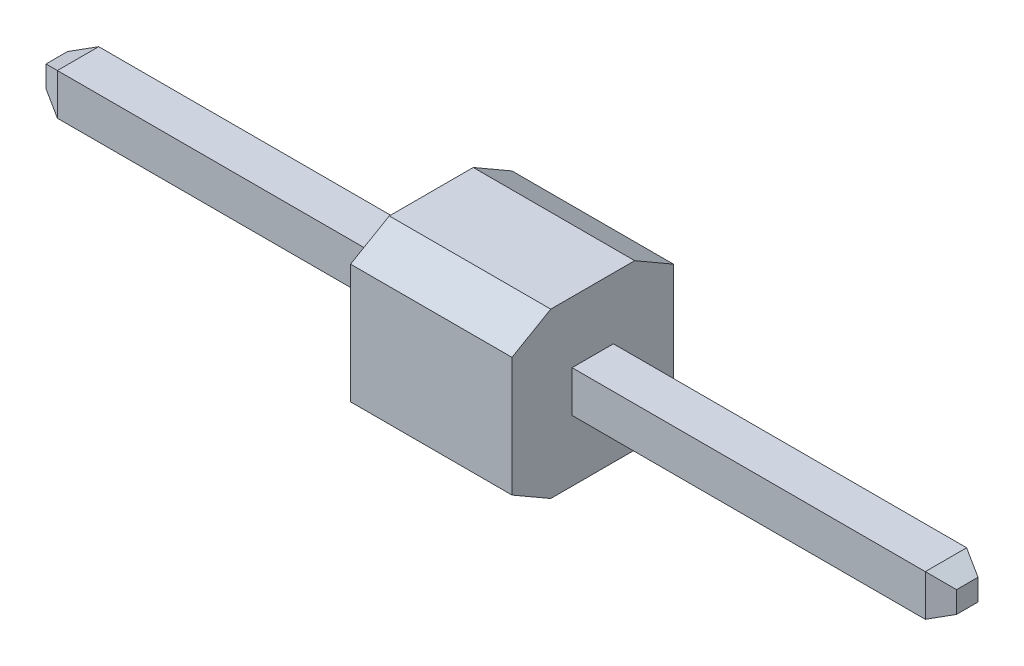
ISO-10303-21;
HEADER;
FILE_DESCRIPTION(('STEP AP214'),'2;1');
FILE_NAME('part.step','',(''),(''),'','','');
FILE_SCHEMA(('AUTOMOTIVE_DESIGN { 1 0 10303 214 1 1 1 1 }'));
ENDSEC;
DATA;
#1=APPLICATION_CONTEXT('core data for automotive mechanical design processes');
#2=APPLICATION_PROTOCOL_DEFINITION('international standard','automotive_design',2000,#1);
#3=PRODUCT_CONTEXT('',#1,'mechanical');
#4=PRODUCT('Part','Part','',(#3));
#5=PRODUCT_RELATED_PRODUCT_CATEGORY('part','',(#4));
#6=PRODUCT_DEFINITION_FORMATION('','',#4);
#7=PRODUCT_DEFINITION_CONTEXT('part definition',#1,'design');
#8=PRODUCT_DEFINITION('design','',#6,#7);
#9=PRODUCT_DEFINITION_SHAPE('','',#8);
#10=(LENGTH_UNIT() NAMED_UNIT(*) SI_UNIT(.MILLI.,.METRE.));
#11=(NAMED_UNIT(*) PLANE_ANGLE_UNIT() SI_UNIT($,.RADIAN.));
#12=(NAMED_UNIT(*) SI_UNIT($,.STERADIAN.) SOLID_ANGLE_UNIT());
#13=UNCERTAINTY_MEASURE_WITH_UNIT(LENGTH_MEASURE(1.E-05),#10,'distance_accuracy_value','');
#14=(GEOMETRIC_REPRESENTATION_CONTEXT(3) GLOBAL_UNCERTAINTY_ASSIGNED_CONTEXT((#13)) GLOBAL_UNIT_ASSIGNED_CONTEXT((#10,
#11,#12)) REPRESENTATION_CONTEXT('',''));
#15=CARTESIAN_POINT('',(0.,0.,0.));
#16=DIRECTION('',(0.,0.,1.));
#17=DIRECTION('',(1.,0.,0.));
#18=AXIS2_PLACEMENT_3D('',#15,#16,#17);
#19=CARTESIAN_POINT('',(5.42104992795993,4.76287173708609,0.629998634255617));
#20=DIRECTION('',(1.,4.37113882867379E-08,-4.37113882867379E-08));
#21=DIRECTION('',(-4.37113882867379E-08,1.,0.));
#22=AXIS2_PLACEMENT_3D('',#19,#20,#21);
#23=PLANE('',#22);
#24=DIRECTION('',(1.59994790123753E-08,0.50000000000019,0.866025403784329));
#25=VECTOR('',#24,1.);
#26=CARTESIAN_POINT('',(5.42104980497401,6.00646157557209,-0.940001365744382));
#27=LINE('',#26,#25);
#28=CARTESIAN_POINT('',(5.42104980497401,6.00646157557209,-0.940001365744382));
#29=VERTEX_POINT('',#28);
#30=CARTESIAN_POINT('',(5.42104981605878,6.35287173708609,-0.340001365744383));
#31=VERTEX_POINT('',#30);
#32=EDGE_CURVE('E11',#29,#31,#27,.T.);
#33=ORIENTED_EDGE('',*,*,#32,.T.);
#34=DIRECTION('',(4.37113886966664E-08,0.,0.999999999999999));
#35=VECTOR('',#34,1.);
#36=CARTESIAN_POINT('',(5.42104981605878,6.35287173708609,-0.340001365744383));
#37=LINE('',#36,#35);
#38=CARTESIAN_POINT('',(5.42104987288358,6.35287173708609,0.959998634255618));
#39=VERTEX_POINT('',#38);
#40=EDGE_CURVE('E304',#31,#39,#37,.T.);
#41=ORIENTED_EDGE('',*,*,#40,.T.);
#42=DIRECTION('',(5.97108656004285E-08,-0.500000000000189,0.866025403784328));
#43=VECTOR('',#42,1.);
#44=CARTESIAN_POINT('',(5.42104987288358,6.35287173708609,0.959998634255618));
#45=LINE('',#44,#43);
#46=CARTESIAN_POINT('',(5.42104991425248,6.00646157557209,1.55999863425562));
#47=VERTEX_POINT('',#46);
#48=EDGE_CURVE('E296',#39,#47,#45,.T.);
#49=ORIENTED_EDGE('',*,*,#48,.T.);
#50=DIRECTION('',(4.37113884815072E-08,-0.999999999999999,0.));
#51=VECTOR('',#50,1.);
#52=CARTESIAN_POINT('',(5.42104991425248,6.00646157557209,1.55999863425562));
#53=LINE('',#52,#51);
#54=CARTESIAN_POINT('',(5.42104999499527,4.15928189860009,1.55999863425562));
#55=VERTEX_POINT('',#54);
#56=EDGE_CURVE('E281',#47,#55,#53,.T.);
#57=ORIENTED_EDGE('',*,*,#56,.T.);
#58=DIRECTION('',(1.59994790123752E-08,0.500000000000192,0.866025403784328));
#59=VECTOR('',#58,1.);
#60=CARTESIAN_POINT('',(5.42104998391051,3.81287173708609,0.959998634255618));
#61=LINE('',#60,#59);
#62=CARTESIAN_POINT('',(5.42104998391051,3.81287173708609,0.959998634255618));
#63=VERTEX_POINT('',#62);
#64=EDGE_CURVE('E265',#63,#55,#61,.T.);
#65=ORIENTED_EDGE('',*,*,#64,.F.);
#66=DIRECTION('',(4.37113880134522E-08,0.,0.999999999999999));
#67=VECTOR('',#66,1.);
#68=CARTESIAN_POINT('',(5.4210499270857,3.81287173708609,-0.340001365744383));
#69=LINE('',#68,#67);
#70=CARTESIAN_POINT('',(5.4210499270857,3.81287173708609,-0.340001365744383));
#71=VERTEX_POINT('',#70);
#72=EDGE_CURVE('E248',#71,#63,#69,.T.);
#73=ORIENTED_EDGE('',*,*,#72,.F.);
#74=DIRECTION('',(5.97108668824036E-08,-0.500000000000187,0.866025403784328));
#75=VECTOR('',#74,1.);
#76=CARTESIAN_POINT('',(5.4210498857168,4.15928189860008,-0.940001365744382));
#77=LINE('',#76,#75);
#78=CARTESIAN_POINT('',(5.4210498857168,4.15928189860008,-0.940001365744382));
#79=VERTEX_POINT('',#78);
#80=EDGE_CURVE('E242',#79,#71,#77,.T.);
#81=ORIENTED_EDGE('',*,*,#80,.F.);
#82=DIRECTION('',(4.37113884815072E-08,-0.999999999999999,0.));
#83=VECTOR('',#82,1.);
#84=CARTESIAN_POINT('',(5.42104980497401,6.00646157557209,-0.940001365744382));
#85=LINE('',#84,#83);
#86=EDGE_CURVE('E236',#29,#79,#85,.T.);
#87=ORIENTED_EDGE('',*,*,#86,.F.);
#88=EDGE_LOOP('',(#33,#41,#49,#57,#65,#73,#81,#87));
#89=FACE_BOUND('',#88,.T.);
#90=DIRECTION('',(-4.37113886753159E-08,0.,-0.999999999999999));
#91=VECTOR('',#90,1.);
#92=CARTESIAN_POINT('',(5.42104989998464,5.40287173708609,0.629998634255617));
#93=LINE('',#92,#91);
#94=CARTESIAN_POINT('',(5.42104989998464,5.40287173708609,0.629998634255617));
#95=VERTEX_POINT('',#94);
#96=CARTESIAN_POINT('',(5.42104987200935,5.40287173708609,-0.0100013657443826));
#97=VERTEX_POINT('',#96);
#98=EDGE_CURVE('E302',#95,#97,#93,.T.);
#99=ORIENTED_EDGE('',*,*,#98,.T.);
#100=DIRECTION('',(-4.3711388675316E-08,0.999999999999999,0.));
#101=VECTOR('',#100,1.);
#102=CARTESIAN_POINT('',(5.42104989998464,4.76287173708609,-0.0100013657443826));
#103=LINE('',#102,#101);
#104=CARTESIAN_POINT('',(5.42104989998464,4.76287173708609,-0.0100013657443826));
#105=VERTEX_POINT('',#104);
#106=EDGE_CURVE('E293',#105,#97,#103,.T.);
#107=ORIENTED_EDGE('',*,*,#106,.F.);
#108=DIRECTION('',(-4.37113886753159E-08,0.,-0.999999999999999));
#109=VECTOR('',#108,1.);
#110=CARTESIAN_POINT('',(5.42104992795993,4.76287173708609,0.629998634255617));
#111=LINE('',#110,#109);
#112=CARTESIAN_POINT('',(5.42104992795993,4.76287173708609,0.629998634255617));
#113=VERTEX_POINT('',#112);
#114=EDGE_CURVE('E278',#113,#105,#111,.T.);
#115=ORIENTED_EDGE('',*,*,#114,.F.);
#116=DIRECTION('',(-4.3711388675316E-08,0.999999999999999,0.));
#117=VECTOR('',#116,1.);
#118=CARTESIAN_POINT('',(5.42104992795993,4.76287173708609,0.629998634255617));
#119=LINE('',#118,#117);
#120=EDGE_CURVE('E263',#113,#95,#119,.T.);
#121=ORIENTED_EDGE('',*,*,#120,.T.);
#122=EDGE_LOOP('',(#99,#107,#115,#121));
#123=FACE_BOUND('',#122,.T.);
#124=ADVANCED_FACE('F17',(#89,#123),#23,.T.);
#125=CARTESIAN_POINT('',(2.92104992795993,4.76287162780762,0.629998743534088));
#126=DIRECTION('',(1.,4.37113882867379E-08,-4.37113882867379E-08));
#127=DIRECTION('',(-4.37113882867379E-08,1.,0.));
#128=AXIS2_PLACEMENT_3D('',#125,#126,#127);
#129=PLANE('',#128);
#130=DIRECTION('',(1.59994790123753E-08,0.50000000000019,0.866025403784329));
#131=VECTOR('',#130,1.);
#132=CARTESIAN_POINT('',(2.92104980497401,6.00646146629361,-0.940001256465912));
#133=LINE('',#132,#131);
#134=CARTESIAN_POINT('',(2.92104980497401,6.00646146629361,-0.940001256465912));
#135=VERTEX_POINT('',#134);
#136=CARTESIAN_POINT('',(2.92104981605878,6.35287162780762,-0.340001256465912));
#137=VERTEX_POINT('',#136);
#138=EDGE_CURVE('E24',#135,#137,#133,.T.);
#139=ORIENTED_EDGE('',*,*,#138,.F.);
#140=DIRECTION('',(4.37113884815072E-08,-0.999999999999999,0.));
#141=VECTOR('',#140,1.);
#142=CARTESIAN_POINT('',(2.92104980497401,6.00646146629361,-0.940001256465912));
#143=LINE('',#142,#141);
#144=CARTESIAN_POINT('',(2.9210498857168,4.15928178932161,-0.940001256465912));
#145=VERTEX_POINT('',#144);
#146=EDGE_CURVE('E300',#135,#145,#143,.T.);
#147=ORIENTED_EDGE('',*,*,#146,.T.);
#148=DIRECTION('',(5.97108668824036E-08,-0.500000000000187,0.866025403784328));
#149=VECTOR('',#148,1.);
#150=CARTESIAN_POINT('',(2.9210498857168,4.15928178932161,-0.940001256465912));
#151=LINE('',#150,#149);
#152=CARTESIAN_POINT('',(2.9210499270857,3.81287162780762,-0.340001256465912));
#153=VERTEX_POINT('',#152);
#154=EDGE_CURVE('E286',#145,#153,#151,.T.);
#155=ORIENTED_EDGE('',*,*,#154,.T.);
#156=DIRECTION('',(4.37113880134522E-08,0.,0.999999999999999));
#157=VECTOR('',#156,1.);
#158=CARTESIAN_POINT('',(2.9210499270857,3.81287162780762,-0.340001256465912));
#159=LINE('',#158,#157);
#160=CARTESIAN_POINT('',(2.92104998391051,3.81287162780762,0.959998743534088));
#161=VERTEX_POINT('',#160);
#162=EDGE_CURVE('E271',#153,#161,#159,.T.);
#163=ORIENTED_EDGE('',*,*,#162,.T.);
#164=DIRECTION('',(1.59994790123752E-08,0.500000000000192,0.866025403784328));
#165=VECTOR('',#164,1.);
#166=CARTESIAN_POINT('',(2.92104998391051,3.81287162780762,0.959998743534088));
#167=LINE('',#166,#165);
#168=CARTESIAN_POINT('',(2.92104999499527,4.15928178932162,1.55999874353409));
#169=VERTEX_POINT('',#168);
#170=EDGE_CURVE('E253',#161,#169,#167,.T.);
#171=ORIENTED_EDGE('',*,*,#170,.T.);
#172=DIRECTION('',(4.37113884815072E-08,-0.999999999999999,0.));
#173=VECTOR('',#172,1.);
#174=CARTESIAN_POINT('',(2.92104991425248,6.00646146629362,1.55999874353409));
#175=LINE('',#174,#173);
#176=CARTESIAN_POINT('',(2.92104991425248,6.00646146629362,1.55999874353409));
#177=VERTEX_POINT('',#176);
#178=EDGE_CURVE('E261',#177,#169,#175,.T.);
#179=ORIENTED_EDGE('',*,*,#178,.F.);
#180=DIRECTION('',(5.9710866241416E-08,-0.500000000000189,0.866025403784328));
#181=VECTOR('',#180,1.);
#182=CARTESIAN_POINT('',(2.92104987288358,6.35287162780762,0.959998743534088));
#183=LINE('',#182,#181);
#184=CARTESIAN_POINT('',(2.92104987288358,6.35287162780762,0.959998743534088));
#185=VERTEX_POINT('',#184);
#186=EDGE_CURVE('E276',#185,#177,#183,.T.);
#187=ORIENTED_EDGE('',*,*,#186,.F.);
#188=DIRECTION('',(4.37113883550593E-08,0.,0.999999999999999));
#189=VECTOR('',#188,1.);
#190=CARTESIAN_POINT('',(2.92104981605878,6.35287162780762,-0.340001256465912));
#191=LINE('',#190,#189);
#192=EDGE_CURVE('E291',#137,#185,#191,.T.);
#193=ORIENTED_EDGE('',*,*,#192,.F.);
#194=EDGE_LOOP('',(#139,#147,#155,#163,#171,#179,#187,#193));
#195=FACE_BOUND('',#194,.T.);
#196=DIRECTION('',(-4.37113879814266E-08,0.999999999999999,0.));
#197=VECTOR('',#196,1.);
#198=CARTESIAN_POINT('',(2.92104989998464,4.76287162780762,-0.0100012564659119));
#199=LINE('',#198,#197);
#200=CARTESIAN_POINT('',(2.92104989998464,4.76287162780762,-0.0100012564659119));
#201=VERTEX_POINT('',#200);
#202=CARTESIAN_POINT('',(2.92104987200935,5.40287162780762,-0.0100012564659119));
#203=VERTEX_POINT('',#202);
#204=EDGE_CURVE('E298',#201,#203,#199,.T.);
#205=ORIENTED_EDGE('',*,*,#204,.T.);
#206=DIRECTION('',(-4.37113879814266E-08,0.,-0.999999999999999));
#207=VECTOR('',#206,1.);
#208=CARTESIAN_POINT('',(2.92104989998464,5.40287162780762,0.629998743534088));
#209=LINE('',#208,#207);
#210=CARTESIAN_POINT('',(2.92104989998464,5.40287162780762,0.629998743534088));
#211=VERTEX_POINT('',#210);
#212=EDGE_CURVE('E283',#211,#203,#209,.T.);
#213=ORIENTED_EDGE('',*,*,#212,.F.);
#214=DIRECTION('',(-4.3711388675316E-08,0.999999999999999,0.));
#215=VECTOR('',#214,1.);
#216=CARTESIAN_POINT('',(2.92104992795993,4.76287162780762,0.629998743534088));
#217=LINE('',#216,#215);
#218=CARTESIAN_POINT('',(2.92104992795993,4.76287162780762,0.629998743534088));
#219=VERTEX_POINT('',#218);
#220=EDGE_CURVE('E268',#219,#211,#217,.T.);
#221=ORIENTED_EDGE('',*,*,#220,.F.);
#222=DIRECTION('',(-4.37113886753159E-08,0.,-0.999999999999999));
#223=VECTOR('',#222,1.);
#224=CARTESIAN_POINT('',(2.92104992795993,4.76287162780762,0.629998743534088));
#225=LINE('',#224,#223);
#226=EDGE_CURVE('E251',#219,#201,#225,.T.);
#227=ORIENTED_EDGE('',*,*,#226,.T.);
#228=EDGE_LOOP('',(#205,#213,#221,#227));
#229=FACE_BOUND('',#228,.T.);
#230=ADVANCED_FACE('F314',(#195,#229),#129,.F.);
#231=CARTESIAN_POINT('',(5.42104980497401,6.00646157557209,-0.940001365744382));
#232=DIRECTION('',(5.97108668343731E-08,-0.866025403784328,0.50000000000019));
#233=DIRECTION('',(-1.59994785476185E-08,-0.500000000000192,-0.866025403784329));
#234=AXIS2_PLACEMENT_3D('',#231,#232,#233);
#235=PLANE('',#234);
#236=ORIENTED_EDGE('',*,*,#138,.T.);
#237=DIRECTION('',(-0.999999999999998,-4.37113886420092E-08,4.37113883755557E-08));
#238=VECTOR('',#237,1.);
#239=CARTESIAN_POINT('',(5.42104981605878,6.35287173708609,-0.340001365744383));
#240=LINE('',#239,#238);
#241=EDGE_CURVE('E288',#31,#137,#240,.T.);
#242=ORIENTED_EDGE('',*,*,#241,.F.);
#243=ORIENTED_EDGE('',*,*,#32,.F.);
#244=DIRECTION('',(-0.999999999999998,-4.37113889972806E-08,4.37113881091022E-08));
#245=VECTOR('',#244,1.);
#246=CARTESIAN_POINT('',(5.42104980497401,6.00646157557209,-0.940001365744382));
#247=LINE('',#246,#245);
#248=EDGE_CURVE('E256',#29,#135,#247,.T.);
#249=ORIENTED_EDGE('',*,*,#248,.T.);
#250=EDGE_LOOP('',(#236,#242,#243,#249));
#251=FACE_BOUND('',#250,.T.);
#252=ADVANCED_FACE('F306',(#251),#235,.F.);
#253=CARTESIAN_POINT('',(5.42104981605878,6.35287173708609,-0.340001365744383));
#254=DIRECTION('',(4.37113882867379E-08,-1.,0.));
#255=DIRECTION('',(1.,4.37113882867379E-08,-4.37113882867379E-08));
#256=AXIS2_PLACEMENT_3D('',#253,#254,#255);
#257=PLANE('',#256);
#258=ORIENTED_EDGE('',*,*,#192,.T.);
#259=DIRECTION('',(-0.999999999999998,-4.37113886420092E-08,4.37113882867378E-08));
#260=VECTOR('',#259,1.);
#261=CARTESIAN_POINT('',(5.42104987288358,6.35287173708609,0.959998634255618));
#262=LINE('',#261,#260);
#263=EDGE_CURVE('E273',#39,#185,#262,.T.);
#264=ORIENTED_EDGE('',*,*,#263,.F.);
#265=ORIENTED_EDGE('',*,*,#40,.F.);
#266=ORIENTED_EDGE('',*,*,#241,.T.);
#267=EDGE_LOOP('',(#258,#264,#265,#266));
#268=FACE_BOUND('',#267,.T.);
#269=ADVANCED_FACE('F311',(#268),#257,.F.);
#270=CARTESIAN_POINT('',(5.42104987288358,6.35287173708609,0.959998634255618));
#271=DIRECTION('',(1.59994785476185E-08,-0.86602540378433,-0.50000000000019));
#272=DIRECTION('',(-5.97108668343731E-08,0.500000000000188,-0.866025403784329));
#273=AXIS2_PLACEMENT_3D('',#270,#271,#272);
#274=PLANE('',#273);
#275=ORIENTED_EDGE('',*,*,#186,.T.);
#276=DIRECTION('',(-0.999999999999998,-4.37113889972806E-08,4.37113882867378E-08));
#277=VECTOR('',#276,1.);
#278=CARTESIAN_POINT('',(5.42104991425248,6.00646157557209,1.55999863425562));
#279=LINE('',#278,#277);
#280=EDGE_CURVE('E258',#47,#177,#279,.T.);
#281=ORIENTED_EDGE('',*,*,#280,.F.);
#282=ORIENTED_EDGE('',*,*,#48,.F.);
#283=ORIENTED_EDGE('',*,*,#263,.T.);
#284=EDGE_LOOP('',(#275,#281,#282,#283));
#285=FACE_BOUND('',#284,.T.);
#286=ADVANCED_FACE('F319',(#285),#274,.F.);
#287=CARTESIAN_POINT('',(5.42104991425248,6.00646157557209,1.55999863425562));
#288=DIRECTION('',(-4.37113882867379E-08,0.,-1.));
#289=DIRECTION('',(-1.,-4.37113882867379E-08,4.37113882867379E-08));
#290=AXIS2_PLACEMENT_3D('',#287,#288,#289);
#291=PLANE('',#290);
#292=ORIENTED_EDGE('',*,*,#178,.T.);
#293=DIRECTION('',(-0.999999999999998,-4.37113882867378E-08,4.37113882867378E-08));
#294=VECTOR('',#293,1.);
#295=CARTESIAN_POINT('',(5.42104999499527,4.15928189860009,1.55999863425562));
#296=LINE('',#295,#294);
#297=EDGE_CURVE('E245',#55,#169,#296,.T.);
#298=ORIENTED_EDGE('',*,*,#297,.F.);
#299=ORIENTED_EDGE('',*,*,#56,.F.);
#300=ORIENTED_EDGE('',*,*,#280,.T.);
#301=EDGE_LOOP('',(#292,#298,#299,#300));
#302=FACE_BOUND('',#301,.T.);
#303=ADVANCED_FACE('F326',(#302),#291,.F.);
#304=CARTESIAN_POINT('',(5.42104998391051,3.81287173708609,0.959998634255618));
#305=DIRECTION('',(5.97108668343731E-08,-0.866025403784328,0.50000000000019));
#306=DIRECTION('',(-1.59994785476185E-08,-0.500000000000192,-0.866025403784329));
#307=AXIS2_PLACEMENT_3D('',#304,#305,#306);
#308=PLANE('',#307);
#309=ORIENTED_EDGE('',*,*,#170,.F.);
#310=DIRECTION('',(-0.999999999999998,-4.37113882867378E-08,4.37113882867378E-08));
#311=VECTOR('',#310,1.);
#312=CARTESIAN_POINT('',(5.42104998391051,3.81287173708609,0.959998634255618));
#313=LINE('',#312,#311);
#314=EDGE_CURVE('E239',#63,#161,#313,.T.);
#315=ORIENTED_EDGE('',*,*,#314,.F.);
#316=ORIENTED_EDGE('',*,*,#64,.T.);
#317=ORIENTED_EDGE('',*,*,#297,.T.);
#318=EDGE_LOOP('',(#309,#315,#316,#317));
#319=FACE_BOUND('',#318,.T.);
#320=ADVANCED_FACE('F329',(#319),#308,.T.);
#321=CARTESIAN_POINT('',(5.4210499270857,3.81287173708609,-0.340001365744383));
#322=DIRECTION('',(4.37113882867379E-08,-1.,0.));
#323=DIRECTION('',(1.,4.37113882867379E-08,-4.37113882867379E-08));
#324=AXIS2_PLACEMENT_3D('',#321,#322,#323);
#325=PLANE('',#324);
#326=ORIENTED_EDGE('',*,*,#162,.F.);
#327=DIRECTION('',(-0.999999999999998,-4.37113882867378E-08,4.37113883755557E-08));
#328=VECTOR('',#327,1.);
#329=CARTESIAN_POINT('',(5.4210499270857,3.81287173708609,-0.340001365744383));
#330=LINE('',#329,#328);
#331=EDGE_CURVE('E233',#71,#153,#330,.T.);
#332=ORIENTED_EDGE('',*,*,#331,.F.);
#333=ORIENTED_EDGE('',*,*,#72,.T.);
#334=ORIENTED_EDGE('',*,*,#314,.T.);
#335=EDGE_LOOP('',(#326,#332,#333,#334));
#336=FACE_BOUND('',#335,.T.);
#337=ADVANCED_FACE('F333',(#336),#325,.T.);
#338=CARTESIAN_POINT('',(5.4210498857168,4.15928189860008,-0.940001365744382));
#339=DIRECTION('',(1.59994785476185E-08,-0.86602540378433,-0.50000000000019));
#340=DIRECTION('',(-5.97108668343731E-08,0.500000000000188,-0.866025403784329));
#341=AXIS2_PLACEMENT_3D('',#338,#339,#340);
#342=PLANE('',#341);
#343=ORIENTED_EDGE('',*,*,#154,.F.);
#344=DIRECTION('',(-0.999999999999998,-4.37113882867378E-08,4.37113881091022E-08));
#345=VECTOR('',#344,1.);
#346=CARTESIAN_POINT('',(5.4210498857168,4.15928189860008,-0.940001365744382));
#347=LINE('',#346,#345);
#348=EDGE_CURVE('E230',#79,#145,#347,.T.);
#349=ORIENTED_EDGE('',*,*,#348,.F.);
#350=ORIENTED_EDGE('',*,*,#80,.T.);
#351=ORIENTED_EDGE('',*,*,#331,.T.);
#352=EDGE_LOOP('',(#343,#349,#350,#351));
#353=FACE_BOUND('',#352,.T.);
#354=ADVANCED_FACE('F337',(#353),#342,.T.);
#355=CARTESIAN_POINT('',(5.42104980497401,6.00646157557209,-0.940001365744382));
#356=DIRECTION('',(-4.37113882867379E-08,0.,-1.));
#357=DIRECTION('',(-4.37113882867379E-08,1.,0.));
#358=AXIS2_PLACEMENT_3D('',#355,#356,#357);
#359=PLANE('',#358);
#360=ORIENTED_EDGE('',*,*,#146,.F.);
#361=ORIENTED_EDGE('',*,*,#248,.F.);
#362=ORIENTED_EDGE('',*,*,#86,.T.);
#363=ORIENTED_EDGE('',*,*,#348,.T.);
#364=EDGE_LOOP('',(#360,#361,#362,#363));
#365=FACE_BOUND('',#364,.T.);
#366=ADVANCED_FACE('F339',(#365),#359,.T.);
#367=CARTESIAN_POINT('',(-2.87895007204007,4.76287137428157,0.62999899706014));
#368=DIRECTION('',(-1.,-4.37113882867379E-08,4.37113882867379E-08));
#369=DIRECTION('',(4.37113882867379E-08,-1.,0.));
#370=AXIS2_PLACEMENT_3D('',#367,#368,#369);
#371=PLANE('',#370);
#372=DIRECTION('',(4.37113927480284E-08,-0.999999999999999,0.));
#373=VECTOR('',#372,1.);
#374=CARTESIAN_POINT('',(-2.8789501145379,5.24898984709056,0.14388052425114));
#375=LINE('',#374,#373);
#376=CARTESIAN_POINT('',(-2.8789501145379,5.24898984709057,0.14388052425114));
#377=VERTEX_POINT('',#376);
#378=CARTESIAN_POINT('',(-2.87895010001536,4.91675290147256,0.14388052425114));
#379=VERTEX_POINT('',#378);
#380=EDGE_CURVE('E228',#377,#379,#375,.T.);
#381=ORIENTED_EDGE('',*,*,#380,.T.);
#382=DIRECTION('',(4.37113874013716E-08,0.,0.999999999999999));
#383=VECTOR('',#382,1.);
#384=CARTESIAN_POINT('',(-2.87895010001536,4.91675290147256,0.14388052425114));
#385=LINE('',#384,#383);
#386=CARTESIAN_POINT('',(-2.87895008549282,4.91675290147257,0.47611746986914));
#387=VERTEX_POINT('',#386);
#388=EDGE_CURVE('E223',#379,#387,#385,.T.);
#389=ORIENTED_EDGE('',*,*,#388,.T.);
#390=DIRECTION('',(-4.37113900747E-08,0.999999999999999,0.));
#391=VECTOR('',#390,1.);
#392=CARTESIAN_POINT('',(-2.87895008549282,4.91675290147257,0.47611746986914));
#393=LINE('',#392,#391);
#394=CARTESIAN_POINT('',(-2.87895010001536,5.24898984709057,0.47611746986914));
#395=VERTEX_POINT('',#394);
#396=EDGE_CURVE('E215',#387,#395,#393,.T.);
#397=ORIENTED_EDGE('',*,*,#396,.T.);
#398=DIRECTION('',(-4.37113820547151E-08,0.,-0.999999999999999));
#399=VECTOR('',#398,1.);
#400=CARTESIAN_POINT('',(-2.87895010001536,5.24898984709057,0.47611746986914));
#401=LINE('',#400,#399);
#402=EDGE_CURVE('E207',#395,#377,#401,.T.);
#403=ORIENTED_EDGE('',*,*,#402,.T.);
#404=EDGE_LOOP('',(#381,#389,#397,#403));
#405=FACE_BOUND('',#404,.T.);
#406=ADVANCED_FACE('F341',(#405),#371,.T.);
#407=CARTESIAN_POINT('',(-2.87895007204007,4.76287137428157,0.62999899706014));
#408=DIRECTION('',(4.37113882867379E-08,-1.,0.));
#409=DIRECTION('',(-4.37113882867379E-08,0.,-1.));
#410=AXIS2_PLACEMENT_3D('',#407,#408,#409);
#411=PLANE('',#410);
#412=DIRECTION('',(0.999999999999998,4.37113888452998E-08,-4.37113882769955E-08));
#413=VECTOR('',#412,1.);
#414=CARTESIAN_POINT('',(-2.54895007204007,4.76287138870632,0.629998982635382));
#415=LINE('',#414,#413);
#416=CARTESIAN_POINT('',(-2.54895007204007,4.76287138870632,0.629998982635382));
#417=VERTEX_POINT('',#416);
#418=EDGE_CURVE('E225',#417,#219,#415,.T.);
#419=ORIENTED_EDGE('',*,*,#418,.F.);
#420=DIRECTION('',(-4.37113886753159E-08,0.,-0.999999999999999));
#421=VECTOR('',#420,1.);
#422=CARTESIAN_POINT('',(-2.54895007204007,4.76287138870632,0.629998982635382));
#423=LINE('',#422,#421);
#424=CARTESIAN_POINT('',(-2.54895010001536,4.76287138870632,-0.010001017364618));
#425=VERTEX_POINT('',#424);
#426=EDGE_CURVE('E217',#417,#425,#423,.T.);
#427=ORIENTED_EDGE('',*,*,#426,.T.);
#428=DIRECTION('',(0.999999999999998,4.37113888452998E-08,-4.37113882161057E-08));
#429=VECTOR('',#428,1.);
#430=CARTESIAN_POINT('',(-2.54895010001536,4.76287138870632,-0.010001017364618));
#431=LINE('',#430,#429);
#432=EDGE_CURVE('E220',#425,#201,#431,.T.);
#433=ORIENTED_EDGE('',*,*,#432,.T.);
#434=ORIENTED_EDGE('',*,*,#226,.F.);
#435=EDGE_LOOP('',(#419,#427,#433,#434));
#436=FACE_BOUND('',#435,.T.);
#437=ADVANCED_FACE('F348',(#436),#411,.T.);
#438=CARTESIAN_POINT('',(-2.87895010001536,4.76287137428156,-0.0100010029398598));
#439=DIRECTION('',(-4.37113882867379E-08,0.,-1.));
#440=DIRECTION('',(-1.,-4.37113882867379E-08,4.37113882867379E-08));
#441=AXIS2_PLACEMENT_3D('',#438,#439,#440);
#442=PLANE('',#441);
#443=ORIENTED_EDGE('',*,*,#432,.F.);
#444=DIRECTION('',(-4.3711388675316E-08,0.999999999999999,0.));
#445=VECTOR('',#444,1.);
#446=CARTESIAN_POINT('',(-2.54895010001536,4.76287138870632,-0.010001017364618));
#447=LINE('',#446,#445);
#448=CARTESIAN_POINT('',(-2.54895012799065,5.40287138870632,-0.010001017364618));
#449=VERTEX_POINT('',#448);
#450=EDGE_CURVE('E209',#425,#449,#447,.T.);
#451=ORIENTED_EDGE('',*,*,#450,.T.);
#452=DIRECTION('',(0.999999999999998,4.37113877086912E-08,-4.37113882161057E-08));
#453=VECTOR('',#452,1.);
#454=CARTESIAN_POINT('',(-2.54895012799065,5.40287138870632,-0.010001017364618));
#455=LINE('',#454,#453);
#456=EDGE_CURVE('E212',#449,#203,#455,.T.);
#457=ORIENTED_EDGE('',*,*,#456,.T.);
#458=ORIENTED_EDGE('',*,*,#204,.F.);
#459=EDGE_LOOP('',(#443,#451,#457,#458));
#460=FACE_BOUND('',#459,.T.);
#461=ADVANCED_FACE('F424',(#460),#442,.T.);
#462=CARTESIAN_POINT('',(-2.87895010001536,5.40287137428157,0.62999899706014));
#463=DIRECTION('',(4.37113882867379E-08,-1.,0.));
#464=DIRECTION('',(-4.37113882867379E-08,0.,-1.));
#465=AXIS2_PLACEMENT_3D('',#462,#463,#464);
#466=PLANE('',#465);
#467=ORIENTED_EDGE('',*,*,#456,.F.);
#468=DIRECTION('',(4.37113900630947E-08,0.,0.999999999999999));
#469=VECTOR('',#468,1.);
#470=CARTESIAN_POINT('',(-2.54895012799065,5.40287138870632,-0.010001017364618));
#471=LINE('',#470,#469);
#472=CARTESIAN_POINT('',(-2.54895010001536,5.40287138870632,0.629998982635382));
#473=VERTEX_POINT('',#472);
#474=EDGE_CURVE('E201',#449,#473,#471,.T.);
#475=ORIENTED_EDGE('',*,*,#474,.T.);
#476=DIRECTION('',(0.999999999999998,4.37113877086912E-08,-4.37113882769955E-08));
#477=VECTOR('',#476,1.);
#478=CARTESIAN_POINT('',(-2.54895010001536,5.40287138870632,0.629998982635382));
#479=LINE('',#478,#477);
#480=EDGE_CURVE('E204',#473,#211,#479,.T.);
#481=ORIENTED_EDGE('',*,*,#480,.T.);
#482=ORIENTED_EDGE('',*,*,#212,.T.);
#483=EDGE_LOOP('',(#467,#475,#481,#482));
#484=FACE_BOUND('',#483,.T.);
#485=ADVANCED_FACE('F421',(#484),#466,.F.);
#486=CARTESIAN_POINT('',(-2.87895007204007,4.76287137428157,0.62999899706014));
#487=DIRECTION('',(-4.37113882867379E-08,0.,-1.));
#488=DIRECTION('',(-1.,-4.37113882867379E-08,4.37113882867379E-08));
#489=AXIS2_PLACEMENT_3D('',#486,#487,#488);
#490=PLANE('',#489);
#491=ORIENTED_EDGE('',*,*,#480,.F.);
#492=DIRECTION('',(4.37113900630949E-08,-0.999999999999999,0.));
#493=VECTOR('',#492,1.);
#494=CARTESIAN_POINT('',(-2.54895010001536,5.40287138870632,0.629998982635382));
#495=LINE('',#494,#493);
#496=EDGE_CURVE('E196',#473,#417,#495,.T.);
#497=ORIENTED_EDGE('',*,*,#496,.T.);
#498=ORIENTED_EDGE('',*,*,#418,.T.);
#499=ORIENTED_EDGE('',*,*,#220,.T.);
#500=EDGE_LOOP('',(#491,#497,#498,#499));
#501=FACE_BOUND('',#500,.T.);
#502=ADVANCED_FACE('F376',(#501),#490,.F.);
#503=CARTESIAN_POINT('',(-2.87895007204007,4.76287137428157,0.62999899706014));
#504=DIRECTION('',(-4.37113882867379E-08,0.,-1.));
#505=DIRECTION('',(-1.,-4.37113882867379E-08,4.37113882867379E-08));
#506=AXIS2_PLACEMENT_3D('',#503,#504,#505);
#507=PLANE('',#506);
#508=DIRECTION('',(0.999999999999998,4.37113909561443E-08,-4.37113882769955E-08));
#509=VECTOR('',#508,1.);
#510=CARTESIAN_POINT('',(5.42104992795993,4.76287173708608,0.629998634255617));
#511=LINE('',#510,#509);
#512=CARTESIAN_POINT('',(10.8910499279599,4.76287197618738,0.629998395154324));
#513=VERTEX_POINT('',#512);
#514=EDGE_CURVE('E199',#113,#513,#511,.T.);
#515=ORIENTED_EDGE('',*,*,#514,.T.);
#516=DIRECTION('',(-4.37113900630947E-08,0.999999999999999,0.));
#517=VECTOR('',#516,1.);
#518=CARTESIAN_POINT('',(10.8910499279599,4.76287197618738,0.629998395154324));
#519=LINE('',#518,#517);
#520=CARTESIAN_POINT('',(10.8910498999846,5.40287197618738,0.629998395154324));
#521=VERTEX_POINT('',#520);
#522=EDGE_CURVE('E191',#513,#521,#519,.T.);
#523=ORIENTED_EDGE('',*,*,#522,.T.);
#524=DIRECTION('',(0.999999999999998,4.37113909561443E-08,-4.37113882769955E-08));
#525=VECTOR('',#524,1.);
#526=CARTESIAN_POINT('',(5.42104989998464,5.40287173708608,0.629998634255617));
#527=LINE('',#526,#525);
#528=EDGE_CURVE('E194',#95,#521,#527,.T.);
#529=ORIENTED_EDGE('',*,*,#528,.F.);
#530=ORIENTED_EDGE('',*,*,#120,.F.);
#531=EDGE_LOOP('',(#515,#523,#529,#530));
#532=FACE_BOUND('',#531,.T.);
#533=ADVANCED_FACE('F367',(#532),#507,.F.);
#534=CARTESIAN_POINT('',(-2.87895010001536,5.40287137428157,0.62999899706014));
#535=DIRECTION('',(4.37113882867379E-08,-1.,0.));
#536=DIRECTION('',(-4.37113882867379E-08,0.,-1.));
#537=AXIS2_PLACEMENT_3D('',#534,#535,#536);
#538=PLANE('',#537);
#539=ORIENTED_EDGE('',*,*,#528,.T.);
#540=DIRECTION('',(-4.37113900630947E-08,0.,-0.999999999999999));
#541=VECTOR('',#540,1.);
#542=CARTESIAN_POINT('',(10.8910498999846,5.40287197618738,0.629998395154324));
#543=LINE('',#542,#541);
#544=CARTESIAN_POINT('',(10.8910498720094,5.40287197618738,-0.0100016048456765));
#545=VERTEX_POINT('',#544);
#546=EDGE_CURVE('E186',#521,#545,#543,.T.);
#547=ORIENTED_EDGE('',*,*,#546,.T.);
#548=DIRECTION('',(0.999999999999998,4.37113909561443E-08,-4.37113881146228E-08));
#549=VECTOR('',#548,1.);
#550=CARTESIAN_POINT('',(5.42104987200935,5.40287173708608,-0.0100013657443823));
#551=LINE('',#550,#549);
#552=EDGE_CURVE('E189',#97,#545,#551,.T.);
#553=ORIENTED_EDGE('',*,*,#552,.F.);
#554=ORIENTED_EDGE('',*,*,#98,.F.);
#555=EDGE_LOOP('',(#539,#547,#553,#554));
#556=FACE_BOUND('',#555,.T.);
#557=ADVANCED_FACE('F364',(#556),#538,.F.);
#558=CARTESIAN_POINT('',(-2.87895010001536,4.76287137428156,-0.0100010029398598));
#559=DIRECTION('',(-4.37113882867379E-08,0.,-1.));
#560=DIRECTION('',(-1.,-4.37113882867379E-08,4.37113882867379E-08));
#561=AXIS2_PLACEMENT_3D('',#558,#559,#560);
#562=PLANE('',#561);
#563=ORIENTED_EDGE('',*,*,#552,.T.);
#564=DIRECTION('',(4.37113872875373E-08,-0.999999999999999,0.));
#565=VECTOR('',#564,1.);
#566=CARTESIAN_POINT('',(10.8910498720094,5.40287197618738,-0.0100016048456764));
#567=LINE('',#566,#565);
#568=CARTESIAN_POINT('',(10.8910498999846,4.76287197618738,-0.0100016048456765));
#569=VERTEX_POINT('',#568);
#570=EDGE_CURVE('E176',#545,#569,#567,.T.);
#571=ORIENTED_EDGE('',*,*,#570,.T.);
#572=DIRECTION('',(0.999999999999998,4.37113909561443E-08,-4.37113881146228E-08));
#573=VECTOR('',#572,1.);
#574=CARTESIAN_POINT('',(5.42104989998464,4.76287173708608,-0.0100013657443823));
#575=LINE('',#574,#573);
#576=EDGE_CURVE('E179',#105,#569,#575,.T.);
#577=ORIENTED_EDGE('',*,*,#576,.F.);
#578=ORIENTED_EDGE('',*,*,#106,.T.);
#579=EDGE_LOOP('',(#563,#571,#577,#578));
#580=FACE_BOUND('',#579,.T.);
#581=ADVANCED_FACE('F366',(#580),#562,.T.);
#582=CARTESIAN_POINT('',(-2.87895007204007,4.76287137428157,0.62999899706014));
#583=DIRECTION('',(4.37113882867379E-08,-1.,0.));
#584=DIRECTION('',(-4.37113882867379E-08,0.,-1.));
#585=AXIS2_PLACEMENT_3D('',#582,#583,#584);
#586=PLANE('',#585);
#587=ORIENTED_EDGE('',*,*,#576,.T.);
#588=DIRECTION('',(4.37113900630947E-08,0.,0.999999999999999));
#589=VECTOR('',#588,1.);
#590=CARTESIAN_POINT('',(10.8910498999846,4.76287197618738,-0.0100016048456765));
#591=LINE('',#590,#589);
#592=EDGE_CURVE('E167',#569,#513,#591,.T.);
#593=ORIENTED_EDGE('',*,*,#592,.T.);
#594=ORIENTED_EDGE('',*,*,#514,.F.);
#595=ORIENTED_EDGE('',*,*,#114,.T.);
#596=EDGE_LOOP('',(#587,#593,#594,#595));
#597=FACE_BOUND('',#596,.T.);
#598=ADVANCED_FACE('F373',(#597),#586,.T.);
#599=CARTESIAN_POINT('',(11.2210499279599,4.76287199061214,0.629998380729565));
#600=DIRECTION('',(-1.,-4.37113882867379E-08,4.37113882867379E-08));
#601=DIRECTION('',(4.37113882867379E-08,-1.,0.));
#602=AXIS2_PLACEMENT_3D('',#599,#600,#601);
#603=PLANE('',#602);
#604=DIRECTION('',(-4.37113927480283E-08,0.999999999999999,0.));
#605=VECTOR('',#604,1.);
#606=CARTESIAN_POINT('',(11.2210498999846,4.91675351780314,0.143879907920565));
#607=LINE('',#606,#605);
#608=CARTESIAN_POINT('',(11.2210498999846,4.91675351780314,0.143879907920565));
#609=VERTEX_POINT('',#608);
#610=CARTESIAN_POINT('',(11.2210498854621,5.24899046342114,0.143879907920565));
#611=VERTEX_POINT('',#610);
#612=EDGE_CURVE('E153',#609,#611,#607,.T.);
#613=ORIENTED_EDGE('',*,*,#612,.T.);
#614=DIRECTION('',(4.37113927480282E-08,0.,0.999999999999999));
#615=VECTOR('',#614,1.);
#616=CARTESIAN_POINT('',(11.2210498854621,5.24899046342114,0.143879907920565));
#617=LINE('',#616,#615);
#618=CARTESIAN_POINT('',(11.2210498999846,5.24899046342114,0.476116853538565));
#619=VERTEX_POINT('',#618);
#620=EDGE_CURVE('E395',#611,#619,#617,.T.);
#621=ORIENTED_EDGE('',*,*,#620,.T.);
#622=DIRECTION('',(4.37113820547153E-08,-0.999999999999999,0.));
#623=VECTOR('',#622,1.);
#624=CARTESIAN_POINT('',(11.2210498999846,5.24899046342114,0.476116853538565));
#625=LINE('',#624,#623);
#626=CARTESIAN_POINT('',(11.2210499145072,4.91675351780314,0.476116853538565));
#627=VERTEX_POINT('',#626);
#628=EDGE_CURVE('E156',#619,#627,#625,.T.);
#629=ORIENTED_EDGE('',*,*,#628,.T.);
#630=DIRECTION('',(-4.37113927480282E-08,0.,-0.999999999999999));
#631=VECTOR('',#630,1.);
#632=CARTESIAN_POINT('',(11.2210499145072,4.91675351780314,0.476116853538565));
#633=LINE('',#632,#631);
#634=EDGE_CURVE('E149',#627,#609,#633,.T.);
#635=ORIENTED_EDGE('',*,*,#634,.T.);
#636=EDGE_LOOP('',(#613,#621,#629,#635));
#637=FACE_BOUND('',#636,.T.);
#638=ADVANCED_FACE('F151',(#637),#603,.F.);
#639=CARTESIAN_POINT('',(-2.87895009328898,5.24898984709057,0.62999899706014));
#640=DIRECTION('',(-0.422618301356784,0.906307768563367,1.84732310895534E-08));
#641=DIRECTION('',(4.37113882867379E-08,0.,1.));
#642=AXIS2_PLACEMENT_3D('',#639,#640,#641);
#643=PLANE('',#642);
#644=DIRECTION('',(0.834817095446926,0.389281657126018,-0.389281657126018));
#645=VECTOR('',#644,1.);
#646=CARTESIAN_POINT('',(-2.87895011453759,5.24898984709023,0.143880524251471));
#647=LINE('',#646,#645);
#648=EDGE_CURVE('E181',#377,#449,#647,.T.);
#649=ORIENTED_EDGE('',*,*,#648,.F.);
#650=ORIENTED_EDGE('',*,*,#402,.F.);
#651=DIRECTION('',(-0.834817129479009,-0.389281657126013,-0.389281584143988));
#652=VECTOR('',#651,1.);
#653=CARTESIAN_POINT('',(-2.54895010001514,5.40287138870609,0.629998982635147));
#654=LINE('',#653,#652);
#655=EDGE_CURVE('E404',#473,#395,#654,.T.);
#656=ORIENTED_EDGE('',*,*,#655,.F.);
#657=ORIENTED_EDGE('',*,*,#474,.F.);
#658=EDGE_LOOP('',(#649,#650,#656,#657));
#659=FACE_BOUND('',#658,.T.);
#660=ADVANCED_FACE('F418',(#659),#643,.T.);
#661=CARTESIAN_POINT('',(-2.87895007876645,4.76287137428157,0.47611746986914));
#662=DIRECTION('',(-0.422618222124841,-1.84732292043498E-08,0.906307805509828));
#663=DIRECTION('',(4.37113882867379E-08,-1.,0.));
#664=AXIS2_PLACEMENT_3D('',#661,#662,#663);
#665=PLANE('',#664);
#666=ORIENTED_EDGE('',*,*,#655,.T.);
#667=ORIENTED_EDGE('',*,*,#396,.F.);
#668=DIRECTION('',(-0.834817163511087,0.389281584143987,-0.389281584143986));
#669=VECTOR('',#668,1.);
#670=CARTESIAN_POINT('',(-2.5489500720399,4.76287138870651,0.629998982635199));
#671=LINE('',#670,#669);
#672=EDGE_CURVE('E160',#417,#387,#671,.T.);
#673=ORIENTED_EDGE('',*,*,#672,.F.);
#674=ORIENTED_EDGE('',*,*,#496,.F.);
#675=EDGE_LOOP('',(#666,#667,#673,#674));
#676=FACE_BOUND('',#675,.T.);
#677=ADVANCED_FACE('F434',(#676),#665,.T.);
#678=CARTESIAN_POINT('',(-2.54895010001536,4.76287138870632,-0.010001017364618));
#679=DIRECTION('',(0.422618301356784,1.8473232667688E-08,0.906307768563367));
#680=DIRECTION('',(-4.37113882867379E-08,1.,0.));
#681=AXIS2_PLACEMENT_3D('',#678,#679,#680);
#682=PLANE('',#681);
#683=ORIENTED_EDGE('',*,*,#648,.T.);
#684=ORIENTED_EDGE('',*,*,#450,.F.);
#685=DIRECTION('',(0.834817129479005,-0.389281584143992,-0.389281657126018));
#686=VECTOR('',#685,1.);
#687=CARTESIAN_POINT('',(-2.87895010001527,4.91675290147266,0.143880524251236));
#688=LINE('',#687,#686);
#689=EDGE_CURVE('E170',#379,#425,#688,.T.);
#690=ORIENTED_EDGE('',*,*,#689,.F.);
#691=ORIENTED_EDGE('',*,*,#380,.F.);
#692=EDGE_LOOP('',(#683,#684,#690,#691));
#693=FACE_BOUND('',#692,.T.);
#694=ADVANCED_FACE('F413',(#693),#682,.F.);
#695=CARTESIAN_POINT('',(-2.54895007204007,4.76287138870632,0.629998982635382));
#696=DIRECTION('',(0.422618222124841,0.906307805509828,-1.84732308250282E-08));
#697=DIRECTION('',(-4.37113882867379E-08,0.,-1.));
#698=AXIS2_PLACEMENT_3D('',#695,#696,#697);
#699=PLANE('',#698);
#700=ORIENTED_EDGE('',*,*,#672,.T.);
#701=ORIENTED_EDGE('',*,*,#388,.F.);
#702=ORIENTED_EDGE('',*,*,#689,.T.);
#703=ORIENTED_EDGE('',*,*,#426,.F.);
#704=EDGE_LOOP('',(#700,#701,#702,#703));
#705=FACE_BOUND('',#704,.T.);
#706=ADVANCED_FACE('F429',(#705),#699,.F.);
#707=CARTESIAN_POINT('',(11.2210499212336,4.91675351780314,0.629998380729565));
#708=DIRECTION('',(0.422618301356784,-0.906307768563367,-1.84732310470096E-08));
#709=DIRECTION('',(4.37113882867379E-08,0.,1.));
#710=AXIS2_PLACEMENT_3D('',#707,#708,#709);
#711=PLANE('',#710);
#712=DIRECTION('',(-0.834817129479008,-0.389281657126016,-0.389281584143986));
#713=VECTOR('',#712,1.);
#714=CARTESIAN_POINT('',(11.2210498999843,4.91675351780347,0.143879907920896));
#715=LINE('',#714,#713);
#716=EDGE_CURVE('E164',#609,#569,#715,.T.);
#717=ORIENTED_EDGE('',*,*,#716,.F.);
#718=ORIENTED_EDGE('',*,*,#634,.F.);
#719=DIRECTION('',(0.834817095446927,0.389281657126015,-0.389281657126019));
#720=VECTOR('',#719,1.);
#721=CARTESIAN_POINT('',(10.8910499279599,4.76287197618738,0.629998395154324));
#722=LINE('',#721,#720);
#723=EDGE_CURVE('E392',#513,#627,#722,.T.);
#724=ORIENTED_EDGE('',*,*,#723,.F.);
#725=ORIENTED_EDGE('',*,*,#592,.F.);
#726=EDGE_LOOP('',(#717,#718,#724,#725));
#727=FACE_BOUND('',#726,.T.);
#728=ADVANCED_FACE('F165',(#727),#711,.T.);
#729=CARTESIAN_POINT('',(10.8910499279599,4.76287197618738,0.629998395154324));
#730=DIRECTION('',(-0.422618301356784,-1.8473232667688E-08,-0.906307768563367));
#731=DIRECTION('',(-4.37113882867379E-08,1.,0.));
#732=AXIS2_PLACEMENT_3D('',#729,#730,#731);
#733=PLANE('',#732);
#734=ORIENTED_EDGE('',*,*,#723,.T.);
#735=ORIENTED_EDGE('',*,*,#628,.F.);
#736=DIRECTION('',(0.834817129479008,-0.389281584143984,-0.389281657126018));
#737=VECTOR('',#736,1.);
#738=CARTESIAN_POINT('',(10.8910498999846,5.40287197618735,0.629998395154179));
#739=LINE('',#738,#737);
#740=EDGE_CURVE('E389',#521,#619,#739,.T.);
#741=ORIENTED_EDGE('',*,*,#740,.F.);
#742=ORIENTED_EDGE('',*,*,#522,.F.);
#743=EDGE_LOOP('',(#734,#735,#741,#742));
#744=FACE_BOUND('',#743,.T.);
#745=ADVANCED_FACE('F390',(#744),#733,.F.);
#746=CARTESIAN_POINT('',(11.221049906711,4.76287199061214,0.143879907920565));
#747=DIRECTION('',(0.422618222124841,1.84732292043498E-08,-0.906307805509828));
#748=DIRECTION('',(4.37113882867379E-08,-1.,0.));
#749=AXIS2_PLACEMENT_3D('',#746,#747,#748);
#750=PLANE('',#749);
#751=ORIENTED_EDGE('',*,*,#716,.T.);
#752=ORIENTED_EDGE('',*,*,#570,.F.);
#753=DIRECTION('',(-0.834817163511086,0.389281584143988,-0.389281584143987));
#754=VECTOR('',#753,1.);
#755=CARTESIAN_POINT('',(11.2210498854618,5.24899046342081,0.143879907920896));
#756=LINE('',#755,#754);
#757=EDGE_CURVE('E175',#611,#545,#756,.T.);
#758=ORIENTED_EDGE('',*,*,#757,.F.);
#759=ORIENTED_EDGE('',*,*,#612,.F.);
#760=EDGE_LOOP('',(#751,#752,#758,#759));
#761=FACE_BOUND('',#760,.T.);
#762=ADVANCED_FACE('F173',(#761),#750,.T.);
#763=CARTESIAN_POINT('',(10.8910498999846,5.40287197618738,0.629998395154324));
#764=DIRECTION('',(-0.422618222124841,-0.906307805509828,1.84732307824844E-08));
#765=DIRECTION('',(-4.37113882867379E-08,0.,-1.));
#766=AXIS2_PLACEMENT_3D('',#763,#764,#765);
#767=PLANE('',#766);
#768=ORIENTED_EDGE('',*,*,#740,.T.);
#769=ORIENTED_EDGE('',*,*,#620,.F.);
#770=ORIENTED_EDGE('',*,*,#757,.T.);
#771=ORIENTED_EDGE('',*,*,#546,.F.);
#772=EDGE_LOOP('',(#768,#769,#770,#771));
#773=FACE_BOUND('',#772,.T.);
#774=ADVANCED_FACE('F394',(#773),#767,.F.);
#775=CLOSED_SHELL('',(#124,#230,#252,#269,#286,#303,#320,#337,#354,#366,#406,#437,#461,#485,
#502,#533,#557,#581,#598,#638,#660,#677,#694,#706,#728,#745,#762,#774));
#776=MANIFOLD_SOLID_BREP('B1',#775);
#777=ADVANCED_BREP_SHAPE_REPRESENTATION('',(#18,#776),#14);
#778=SHAPE_DEFINITION_REPRESENTATION(#9,#777);
ENDSEC;
END-ISO-10303-21;
